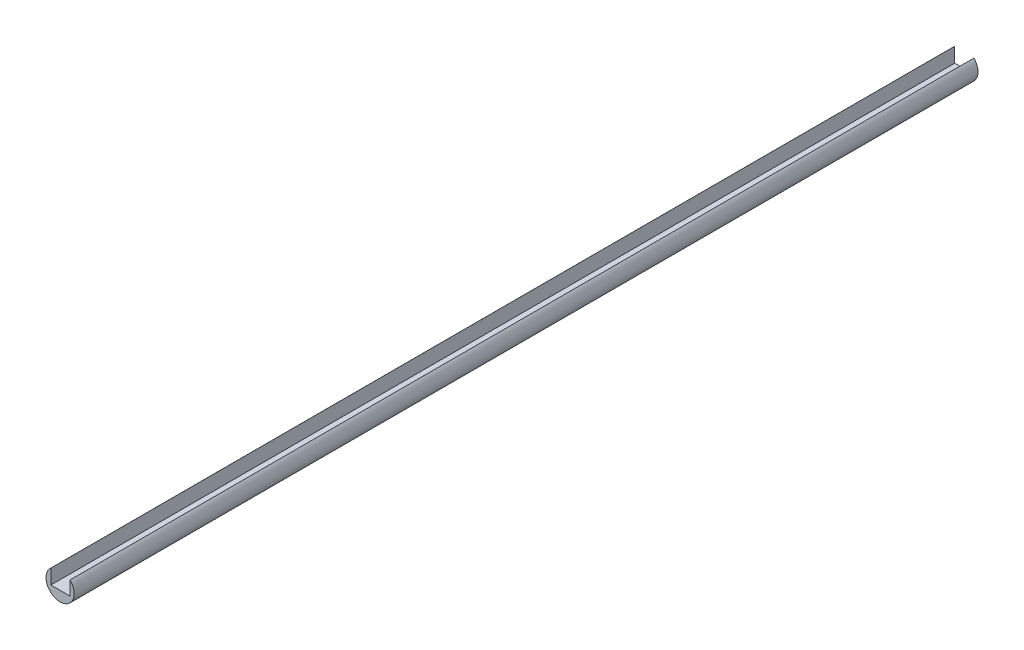
ISO-10303-21;
HEADER;
FILE_DESCRIPTION(('STEP AP214'),'2;1');
FILE_NAME('part.step','',(''),(''),'','','');
FILE_SCHEMA(('AUTOMOTIVE_DESIGN { 1 0 10303 214 1 1 1 1 }'));
ENDSEC;
DATA;
#1=APPLICATION_CONTEXT('core data for automotive mechanical design processes');
#2=APPLICATION_PROTOCOL_DEFINITION('international standard','automotive_design',2000,#1);
#3=PRODUCT_CONTEXT('',#1,'mechanical');
#4=PRODUCT('Part','Part','',(#3));
#5=PRODUCT_RELATED_PRODUCT_CATEGORY('part','',(#4));
#6=PRODUCT_DEFINITION_FORMATION('','',#4);
#7=PRODUCT_DEFINITION_CONTEXT('part definition',#1,'design');
#8=PRODUCT_DEFINITION('design','',#6,#7);
#9=PRODUCT_DEFINITION_SHAPE('','',#8);
#10=(LENGTH_UNIT() NAMED_UNIT(*) SI_UNIT(.MILLI.,.METRE.));
#11=(NAMED_UNIT(*) PLANE_ANGLE_UNIT() SI_UNIT($,.RADIAN.));
#12=(NAMED_UNIT(*) SI_UNIT($,.STERADIAN.) SOLID_ANGLE_UNIT());
#13=UNCERTAINTY_MEASURE_WITH_UNIT(LENGTH_MEASURE(1.E-05),#10,'distance_accuracy_value','');
#14=(GEOMETRIC_REPRESENTATION_CONTEXT(3) GLOBAL_UNCERTAINTY_ASSIGNED_CONTEXT((#13)) GLOBAL_UNIT_ASSIGNED_CONTEXT((#10,
#11,#12)) REPRESENTATION_CONTEXT('',''));
#15=CARTESIAN_POINT('',(0.,0.,0.));
#16=DIRECTION('',(0.,0.,1.));
#17=DIRECTION('',(1.,0.,0.));
#18=AXIS2_PLACEMENT_3D('',#15,#16,#17);
#19=CARTESIAN_POINT('',(-85.8142801734666,-49.5448977584654,600.));
#20=DIRECTION('',(0.,0.,-1.));
#21=DIRECTION('',(-1.,0.,0.));
#22=AXIS2_PLACEMENT_3D('',#19,#20,#21);
#23=CYLINDRICAL_SURFACE('',#22,9.3434546641274);
#24=CARTESIAN_POINT('',(-85.8142801734666,-49.5448977584654,0.));
#25=DIRECTION('',(0.,0.,1.));
#26=DIRECTION('',(1.,0.,0.));
#27=AXIS2_PLACEMENT_3D('',#24,#25,#26);
#28=CIRCLE('',#27,9.3434546641274);
#29=CARTESIAN_POINT('',(-91.9221483689577,-42.4742477765251,0.));
#30=VERTEX_POINT('',#29);
#31=CARTESIAN_POINT('',(-79.1990424794922,-42.9465058852266,0.));
#32=VERTEX_POINT('',#31);
#33=EDGE_CURVE('E36',#30,#32,#28,.T.);
#34=ORIENTED_EDGE('',*,*,#33,.T.);
#35=DIRECTION('',(0.,0.,1.));
#36=VECTOR('',#35,1.);
#37=CARTESIAN_POINT('',(-79.1990424794922,-42.9465058852266,0.));
#38=LINE('',#37,#36);
#39=CARTESIAN_POINT('',(-79.1990424794922,-42.9465058852266,600.));
#40=VERTEX_POINT('',#39);
#41=EDGE_CURVE('E56',#32,#40,#38,.T.);
#42=ORIENTED_EDGE('',*,*,#41,.T.);
#43=CARTESIAN_POINT('',(-85.8142801734666,-49.5448977584654,600.));
#44=DIRECTION('',(0.,0.,1.));
#45=DIRECTION('',(1.,0.,0.));
#46=AXIS2_PLACEMENT_3D('',#43,#44,#45);
#47=CIRCLE('',#46,9.3434546641274);
#48=CARTESIAN_POINT('',(-91.9221483689577,-42.4742477765251,600.));
#49=VERTEX_POINT('',#48);
#50=EDGE_CURVE('E11',#49,#40,#47,.T.);
#51=ORIENTED_EDGE('',*,*,#50,.F.);
#52=DIRECTION('',(0.,0.,1.));
#53=VECTOR('',#52,1.);
#54=CARTESIAN_POINT('',(-91.9221483689577,-42.4742477765251,0.));
#55=LINE('',#54,#53);
#56=EDGE_CURVE('E79',#30,#49,#55,.T.);
#57=ORIENTED_EDGE('',*,*,#56,.F.);
#58=EDGE_LOOP('',(#34,#42,#51,#57));
#59=FACE_BOUND('',#58,.T.);
#60=ADVANCED_FACE('F33',(#59),#23,.T.);
#61=CARTESIAN_POINT('',(-85.8142801734666,-49.5448977584654,600.));
#62=DIRECTION('',(0.,0.,1.));
#63=DIRECTION('',(1.,0.,0.));
#64=AXIS2_PLACEMENT_3D('',#61,#62,#63);
#65=PLANE('',#64);
#66=DIRECTION('',(0.,1.,0.));
#67=VECTOR('',#66,1.);
#68=CARTESIAN_POINT('',(-79.1990424794922,-52.2340400494982,600.));
#69=LINE('',#68,#67);
#70=CARTESIAN_POINT('',(-79.1990424794922,-52.2340400494982,600.));
#71=VERTEX_POINT('',#70);
#72=EDGE_CURVE('E71',#71,#40,#69,.T.);
#73=ORIENTED_EDGE('',*,*,#72,.F.);
#74=DIRECTION('',(1.,0.,0.));
#75=VECTOR('',#74,1.);
#76=CARTESIAN_POINT('',(-91.9221483689577,-52.2340400494982,600.));
#77=LINE('',#76,#75);
#78=CARTESIAN_POINT('',(-91.9221483689577,-52.2340400494982,600.));
#79=VERTEX_POINT('',#78);
#80=EDGE_CURVE('E100',#79,#71,#77,.T.);
#81=ORIENTED_EDGE('',*,*,#80,.F.);
#82=DIRECTION('',(0.,-1.,0.));
#83=VECTOR('',#82,1.);
#84=CARTESIAN_POINT('',(-91.9221483689577,-42.4742477765251,600.));
#85=LINE('',#84,#83);
#86=EDGE_CURVE('E101',#49,#79,#85,.T.);
#87=ORIENTED_EDGE('',*,*,#86,.F.);
#88=ORIENTED_EDGE('',*,*,#50,.T.);
#89=EDGE_LOOP('',(#73,#81,#87,#88));
#90=FACE_BOUND('',#89,.T.);
#91=ADVANCED_FACE('F104',(#90),#65,.T.);
#92=CARTESIAN_POINT('',(-85.8142801734666,-49.5448977584654,0.));
#93=DIRECTION('',(0.,0.,1.));
#94=DIRECTION('',(1.,0.,0.));
#95=AXIS2_PLACEMENT_3D('',#92,#93,#94);
#96=PLANE('',#95);
#97=DIRECTION('',(1.,0.,0.));
#98=VECTOR('',#97,1.);
#99=CARTESIAN_POINT('',(-91.9221483689577,-52.2340400494982,0.));
#100=LINE('',#99,#98);
#101=CARTESIAN_POINT('',(-91.9221483689577,-52.2340400494982,0.));
#102=VERTEX_POINT('',#101);
#103=CARTESIAN_POINT('',(-79.1990424794922,-52.2340400494982,0.));
#104=VERTEX_POINT('',#103);
#105=EDGE_CURVE('E47',#102,#104,#100,.T.);
#106=ORIENTED_EDGE('',*,*,#105,.T.);
#107=DIRECTION('',(0.,1.,0.));
#108=VECTOR('',#107,1.);
#109=CARTESIAN_POINT('',(-79.1990424794922,-52.2340400494982,0.));
#110=LINE('',#109,#108);
#111=EDGE_CURVE('E88',#104,#32,#110,.T.);
#112=ORIENTED_EDGE('',*,*,#111,.T.);
#113=ORIENTED_EDGE('',*,*,#33,.F.);
#114=DIRECTION('',(0.,-1.,0.));
#115=VECTOR('',#114,1.);
#116=CARTESIAN_POINT('',(-91.9221483689577,-42.4742477765251,0.));
#117=LINE('',#116,#115);
#118=EDGE_CURVE('E75',#30,#102,#117,.T.);
#119=ORIENTED_EDGE('',*,*,#118,.T.);
#120=EDGE_LOOP('',(#106,#112,#113,#119));
#121=FACE_BOUND('',#120,.T.);
#122=ADVANCED_FACE('F90',(#121),#96,.F.);
#123=CARTESIAN_POINT('',(-79.1990424794922,-52.2340400494982,0.));
#124=DIRECTION('',(1.,0.,0.));
#125=DIRECTION('',(0.,0.,-1.));
#126=AXIS2_PLACEMENT_3D('',#123,#124,#125);
#127=PLANE('',#126);
#128=ORIENTED_EDGE('',*,*,#72,.T.);
#129=ORIENTED_EDGE('',*,*,#41,.F.);
#130=ORIENTED_EDGE('',*,*,#111,.F.);
#131=DIRECTION('',(0.,0.,1.));
#132=VECTOR('',#131,1.);
#133=CARTESIAN_POINT('',(-79.1990424794922,-52.2340400494982,0.));
#134=LINE('',#133,#132);
#135=EDGE_CURVE('E91',#104,#71,#134,.T.);
#136=ORIENTED_EDGE('',*,*,#135,.T.);
#137=EDGE_LOOP('',(#128,#129,#130,#136));
#138=FACE_BOUND('',#137,.T.);
#139=ADVANCED_FACE('F113',(#138),#127,.F.);
#140=CARTESIAN_POINT('',(-91.9221483689577,-52.2340400494982,0.));
#141=DIRECTION('',(0.,-1.,0.));
#142=DIRECTION('',(0.,0.,-1.));
#143=AXIS2_PLACEMENT_3D('',#140,#141,#142);
#144=PLANE('',#143);
#145=ORIENTED_EDGE('',*,*,#80,.T.);
#146=ORIENTED_EDGE('',*,*,#135,.F.);
#147=ORIENTED_EDGE('',*,*,#105,.F.);
#148=DIRECTION('',(0.,0.,1.));
#149=VECTOR('',#148,1.);
#150=CARTESIAN_POINT('',(-91.9221483689577,-52.2340400494982,0.));
#151=LINE('',#150,#149);
#152=EDGE_CURVE('E81',#102,#79,#151,.T.);
#153=ORIENTED_EDGE('',*,*,#152,.T.);
#154=EDGE_LOOP('',(#145,#146,#147,#153));
#155=FACE_BOUND('',#154,.T.);
#156=ADVANCED_FACE('F98',(#155),#144,.F.);
#157=CARTESIAN_POINT('',(-91.9221483689577,-42.4742477765251,0.));
#158=DIRECTION('',(-1.,0.,0.));
#159=DIRECTION('',(0.,0.,1.));
#160=AXIS2_PLACEMENT_3D('',#157,#158,#159);
#161=PLANE('',#160);
#162=ORIENTED_EDGE('',*,*,#86,.T.);
#163=ORIENTED_EDGE('',*,*,#152,.F.);
#164=ORIENTED_EDGE('',*,*,#118,.F.);
#165=ORIENTED_EDGE('',*,*,#56,.T.);
#166=EDGE_LOOP('',(#162,#163,#164,#165));
#167=FACE_BOUND('',#166,.T.);
#168=ADVANCED_FACE('F78',(#167),#161,.F.);
#169=CLOSED_SHELL('',(#60,#91,#122,#139,#156,#168));
#170=MANIFOLD_SOLID_BREP('B2',#169);
#171=ADVANCED_BREP_SHAPE_REPRESENTATION('',(#18,#170),#14);
#172=SHAPE_DEFINITION_REPRESENTATION(#9,#171);
ENDSEC;
END-ISO-10303-21;
